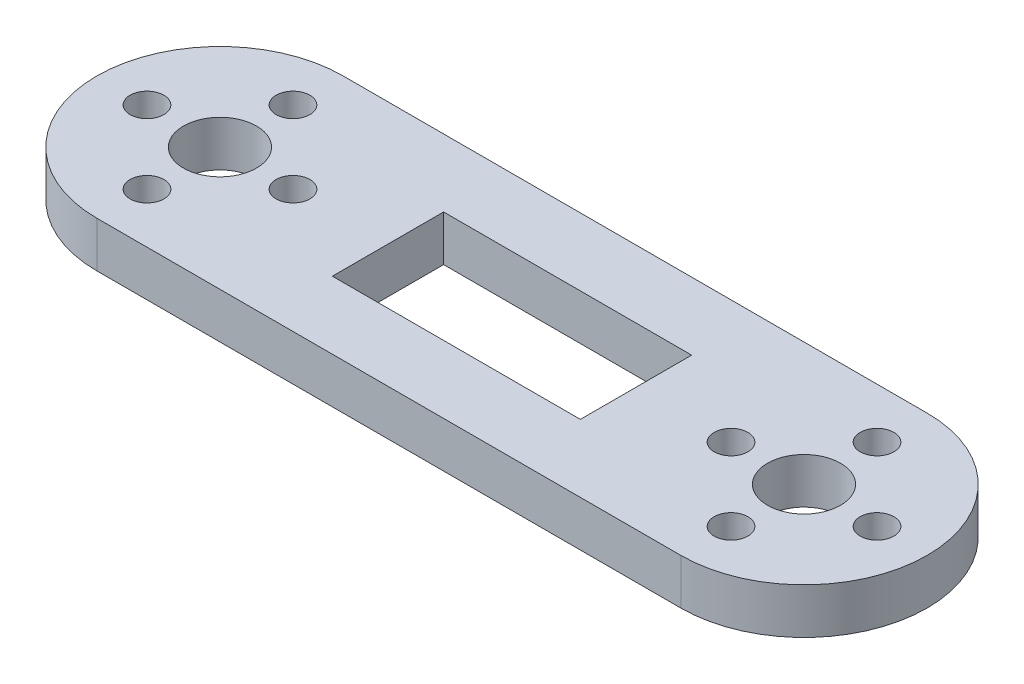
ISO-10303-21;
HEADER;
FILE_DESCRIPTION(('STEP AP214'),'2;1');
FILE_NAME('part.step','',(''),(''),'','','');
FILE_SCHEMA(('AUTOMOTIVE_DESIGN { 1 0 10303 214 1 1 1 1 }'));
ENDSEC;
DATA;
#1=APPLICATION_CONTEXT('core data for automotive mechanical design processes');
#2=APPLICATION_PROTOCOL_DEFINITION('international standard','automotive_design',2000,#1);
#3=PRODUCT_CONTEXT('',#1,'mechanical');
#4=PRODUCT('Part','Part','',(#3));
#5=PRODUCT_RELATED_PRODUCT_CATEGORY('part','',(#4));
#6=PRODUCT_DEFINITION_FORMATION('','',#4);
#7=PRODUCT_DEFINITION_CONTEXT('part definition',#1,'design');
#8=PRODUCT_DEFINITION('design','',#6,#7);
#9=PRODUCT_DEFINITION_SHAPE('','',#8);
#10=(LENGTH_UNIT() NAMED_UNIT(*) SI_UNIT(.MILLI.,.METRE.));
#11=(NAMED_UNIT(*) PLANE_ANGLE_UNIT() SI_UNIT($,.RADIAN.));
#12=(NAMED_UNIT(*) SI_UNIT($,.STERADIAN.) SOLID_ANGLE_UNIT());
#13=UNCERTAINTY_MEASURE_WITH_UNIT(LENGTH_MEASURE(1.E-05),#10,'distance_accuracy_value','');
#14=(GEOMETRIC_REPRESENTATION_CONTEXT(3) GLOBAL_UNCERTAINTY_ASSIGNED_CONTEXT((#13)) GLOBAL_UNIT_ASSIGNED_CONTEXT((#10,
#11,#12)) REPRESENTATION_CONTEXT('',''));
#15=CARTESIAN_POINT('',(0.,0.,0.));
#16=DIRECTION('',(0.,0.,1.));
#17=DIRECTION('',(1.,0.,0.));
#18=AXIS2_PLACEMENT_3D('',#15,#16,#17);
#19=CARTESIAN_POINT('',(64.,0.,0.));
#20=DIRECTION('',(0.,1.,0.));
#21=DIRECTION('',(0.,0.,1.));
#22=AXIS2_PLACEMENT_3D('',#19,#20,#21);
#23=CYLINDRICAL_SURFACE('',#22,13.5);
#24=CARTESIAN_POINT('',(64.,5.,0.));
#25=DIRECTION('',(0.,1.,0.));
#26=DIRECTION('',(0.,0.,1.));
#27=AXIS2_PLACEMENT_3D('',#24,#25,#26);
#28=CIRCLE('',#27,13.5);
#29=CARTESIAN_POINT('',(64.,5.,13.5));
#30=VERTEX_POINT('',#29);
#31=CARTESIAN_POINT('',(64.,5.,-13.5));
#32=VERTEX_POINT('',#31);
#33=EDGE_CURVE('E139',#30,#32,#28,.T.);
#34=ORIENTED_EDGE('',*,*,#33,.F.);
#35=DIRECTION('',(0.,1.,0.));
#36=VECTOR('',#35,1.);
#37=CARTESIAN_POINT('',(64.,0.,13.5));
#38=LINE('',#37,#36);
#39=CARTESIAN_POINT('',(64.,0.,13.5));
#40=VERTEX_POINT('',#39);
#41=EDGE_CURVE('E11',#40,#30,#38,.T.);
#42=ORIENTED_EDGE('',*,*,#41,.F.);
#43=CARTESIAN_POINT('',(64.,0.,0.));
#44=DIRECTION('',(0.,1.,0.));
#45=DIRECTION('',(0.,0.,1.));
#46=AXIS2_PLACEMENT_3D('',#43,#44,#45);
#47=CIRCLE('',#46,13.5);
#48=CARTESIAN_POINT('',(64.,0.,-13.5));
#49=VERTEX_POINT('',#48);
#50=EDGE_CURVE('E143',#40,#49,#47,.T.);
#51=ORIENTED_EDGE('',*,*,#50,.T.);
#52=DIRECTION('',(0.,1.,0.));
#53=VECTOR('',#52,1.);
#54=CARTESIAN_POINT('',(64.,0.,-13.5));
#55=LINE('',#54,#53);
#56=EDGE_CURVE('E40',#49,#32,#55,.T.);
#57=ORIENTED_EDGE('',*,*,#56,.T.);
#58=EDGE_LOOP('',(#34,#42,#51,#57));
#59=FACE_BOUND('',#58,.T.);
#60=ADVANCED_FACE('F37',(#59),#23,.T.);
#61=CARTESIAN_POINT('',(0.,0.,13.5));
#62=DIRECTION('',(0.,0.,1.));
#63=DIRECTION('',(1.,0.,0.));
#64=AXIS2_PLACEMENT_3D('',#61,#62,#63);
#65=PLANE('',#64);
#66=DIRECTION('',(1.,0.,0.));
#67=VECTOR('',#66,1.);
#68=CARTESIAN_POINT('',(0.,5.,13.5));
#69=LINE('',#68,#67);
#70=CARTESIAN_POINT('',(0.,5.,13.5));
#71=VERTEX_POINT('',#70);
#72=EDGE_CURVE('E147',#71,#30,#69,.T.);
#73=ORIENTED_EDGE('',*,*,#72,.F.);
#74=DIRECTION('',(0.,1.,0.));
#75=VECTOR('',#74,1.);
#76=CARTESIAN_POINT('',(0.,0.,13.5));
#77=LINE('',#76,#75);
#78=CARTESIAN_POINT('',(0.,0.,13.5));
#79=VERTEX_POINT('',#78);
#80=EDGE_CURVE('E45',#79,#71,#77,.T.);
#81=ORIENTED_EDGE('',*,*,#80,.F.);
#82=DIRECTION('',(1.,0.,0.));
#83=VECTOR('',#82,1.);
#84=CARTESIAN_POINT('',(0.,0.,13.5));
#85=LINE('',#84,#83);
#86=EDGE_CURVE('E153',#79,#40,#85,.T.);
#87=ORIENTED_EDGE('',*,*,#86,.T.);
#88=ORIENTED_EDGE('',*,*,#41,.T.);
#89=EDGE_LOOP('',(#73,#81,#87,#88));
#90=FACE_BOUND('',#89,.T.);
#91=ADVANCED_FACE('F179',(#90),#65,.T.);
#92=CARTESIAN_POINT('',(0.,0.,0.));
#93=DIRECTION('',(0.,1.,0.));
#94=DIRECTION('',(0.,0.,1.));
#95=AXIS2_PLACEMENT_3D('',#92,#93,#94);
#96=CYLINDRICAL_SURFACE('',#95,13.5);
#97=CARTESIAN_POINT('',(0.,5.,0.));
#98=DIRECTION('',(0.,1.,0.));
#99=DIRECTION('',(0.,0.,1.));
#100=AXIS2_PLACEMENT_3D('',#97,#98,#99);
#101=CIRCLE('',#100,13.5);
#102=CARTESIAN_POINT('',(0.,5.,-13.5));
#103=VERTEX_POINT('',#102);
#104=EDGE_CURVE('E161',#103,#71,#101,.T.);
#105=ORIENTED_EDGE('',*,*,#104,.F.);
#106=DIRECTION('',(0.,1.,0.));
#107=VECTOR('',#106,1.);
#108=CARTESIAN_POINT('',(0.,0.,-13.5));
#109=LINE('',#108,#107);
#110=CARTESIAN_POINT('',(0.,0.,-13.5));
#111=VERTEX_POINT('',#110);
#112=EDGE_CURVE('E166',#111,#103,#109,.T.);
#113=ORIENTED_EDGE('',*,*,#112,.F.);
#114=CARTESIAN_POINT('',(0.,0.,0.));
#115=DIRECTION('',(0.,1.,0.));
#116=DIRECTION('',(0.,0.,1.));
#117=AXIS2_PLACEMENT_3D('',#114,#115,#116);
#118=CIRCLE('',#117,13.5);
#119=EDGE_CURVE('E150',#111,#79,#118,.T.);
#120=ORIENTED_EDGE('',*,*,#119,.T.);
#121=ORIENTED_EDGE('',*,*,#80,.T.);
#122=EDGE_LOOP('',(#105,#113,#120,#121));
#123=FACE_BOUND('',#122,.T.);
#124=ADVANCED_FACE('F183',(#123),#96,.T.);
#125=CARTESIAN_POINT('',(64.,0.,-13.5));
#126=DIRECTION('',(0.,0.,-1.));
#127=DIRECTION('',(-1.,0.,0.));
#128=AXIS2_PLACEMENT_3D('',#125,#126,#127);
#129=PLANE('',#128);
#130=DIRECTION('',(-1.,0.,0.));
#131=VECTOR('',#130,1.);
#132=CARTESIAN_POINT('',(64.,5.,-13.5));
#133=LINE('',#132,#131);
#134=EDGE_CURVE('E158',#32,#103,#133,.T.);
#135=ORIENTED_EDGE('',*,*,#134,.F.);
#136=ORIENTED_EDGE('',*,*,#56,.F.);
#137=DIRECTION('',(-1.,0.,0.));
#138=VECTOR('',#137,1.);
#139=CARTESIAN_POINT('',(64.,0.,-13.5));
#140=LINE('',#139,#138);
#141=EDGE_CURVE('E146',#49,#111,#140,.T.);
#142=ORIENTED_EDGE('',*,*,#141,.T.);
#143=ORIENTED_EDGE('',*,*,#112,.T.);
#144=EDGE_LOOP('',(#135,#136,#142,#143));
#145=FACE_BOUND('',#144,.T.);
#146=ADVANCED_FACE('F174',(#145),#129,.T.);
#147=CARTESIAN_POINT('',(64.,0.,0.));
#148=DIRECTION('',(0.,1.,0.));
#149=DIRECTION('',(0.,0.,1.));
#150=AXIS2_PLACEMENT_3D('',#147,#148,#149);
#151=PLANE('',#150);
#152=CARTESIAN_POINT('',(0.,0.,0.));
#153=DIRECTION('',(0.,1.,0.));
#154=DIRECTION('',(0.,0.,-1.));
#155=AXIS2_PLACEMENT_3D('',#152,#153,#154);
#156=CIRCLE('',#155,4.);
#157=CARTESIAN_POINT('',(0.,0.,-4.));
#158=VERTEX_POINT('',#157);
#159=EDGE_CURVE('E368',#158,#158,#156,.T.);
#160=ORIENTED_EDGE('',*,*,#159,.T.);
#161=EDGE_LOOP('',(#160));
#162=FACE_BOUND('',#161,.T.);
#163=CARTESIAN_POINT('',(0.,0.,-8.));
#164=DIRECTION('',(0.,1.,0.));
#165=DIRECTION('',(0.,0.,-1.));
#166=AXIS2_PLACEMENT_3D('',#163,#164,#165);
#167=CIRCLE('',#166,1.85);
#168=CARTESIAN_POINT('',(0.,0.,-9.85));
#169=VERTEX_POINT('',#168);
#170=EDGE_CURVE('E376',#169,#169,#167,.T.);
#171=ORIENTED_EDGE('',*,*,#170,.T.);
#172=EDGE_LOOP('',(#171));
#173=FACE_BOUND('',#172,.T.);
#174=CARTESIAN_POINT('',(8.,0.,0.));
#175=DIRECTION('',(0.,1.,0.));
#176=DIRECTION('',(0.,0.,-1.));
#177=AXIS2_PLACEMENT_3D('',#174,#175,#176);
#178=CIRCLE('',#177,1.85);
#179=CARTESIAN_POINT('',(8.,0.,-1.85));
#180=VERTEX_POINT('',#179);
#181=EDGE_CURVE('E382',#180,#180,#178,.T.);
#182=ORIENTED_EDGE('',*,*,#181,.T.);
#183=EDGE_LOOP('',(#182));
#184=FACE_BOUND('',#183,.T.);
#185=CARTESIAN_POINT('',(0.,0.,8.));
#186=DIRECTION('',(0.,1.,0.));
#187=DIRECTION('',(0.,0.,-1.));
#188=AXIS2_PLACEMENT_3D('',#185,#186,#187);
#189=CIRCLE('',#188,1.85);
#190=CARTESIAN_POINT('',(0.,0.,6.15));
#191=VERTEX_POINT('',#190);
#192=EDGE_CURVE('E388',#191,#191,#189,.T.);
#193=ORIENTED_EDGE('',*,*,#192,.T.);
#194=EDGE_LOOP('',(#193));
#195=FACE_BOUND('',#194,.T.);
#196=CARTESIAN_POINT('',(-8.,0.,0.));
#197=DIRECTION('',(0.,1.,0.));
#198=DIRECTION('',(0.,0.,-1.));
#199=AXIS2_PLACEMENT_3D('',#196,#197,#198);
#200=CIRCLE('',#199,1.85);
#201=CARTESIAN_POINT('',(-8.,0.,-1.85));
#202=VERTEX_POINT('',#201);
#203=EDGE_CURVE('E394',#202,#202,#200,.T.);
#204=ORIENTED_EDGE('',*,*,#203,.T.);
#205=EDGE_LOOP('',(#204));
#206=FACE_BOUND('',#205,.T.);
#207=CARTESIAN_POINT('',(64.,0.,0.));
#208=DIRECTION('',(0.,1.,0.));
#209=DIRECTION('',(0.,0.,-1.));
#210=AXIS2_PLACEMENT_3D('',#207,#208,#209);
#211=CIRCLE('',#210,4.);
#212=CARTESIAN_POINT('',(64.,0.,-4.));
#213=VERTEX_POINT('',#212);
#214=EDGE_CURVE('E400',#213,#213,#211,.T.);
#215=ORIENTED_EDGE('',*,*,#214,.T.);
#216=EDGE_LOOP('',(#215));
#217=FACE_BOUND('',#216,.T.);
#218=CARTESIAN_POINT('',(64.,0.,-8.));
#219=DIRECTION('',(0.,1.,0.));
#220=DIRECTION('',(0.,0.,-1.));
#221=AXIS2_PLACEMENT_3D('',#218,#219,#220);
#222=CIRCLE('',#221,1.85);
#223=CARTESIAN_POINT('',(64.,0.,-9.85));
#224=VERTEX_POINT('',#223);
#225=EDGE_CURVE('E406',#224,#224,#222,.T.);
#226=ORIENTED_EDGE('',*,*,#225,.T.);
#227=EDGE_LOOP('',(#226));
#228=FACE_BOUND('',#227,.T.);
#229=CARTESIAN_POINT('',(72.,0.,0.));
#230=DIRECTION('',(0.,1.,0.));
#231=DIRECTION('',(0.,0.,-1.));
#232=AXIS2_PLACEMENT_3D('',#229,#230,#231);
#233=CIRCLE('',#232,1.85);
#234=CARTESIAN_POINT('',(72.,0.,-1.85));
#235=VERTEX_POINT('',#234);
#236=EDGE_CURVE('E412',#235,#235,#233,.T.);
#237=ORIENTED_EDGE('',*,*,#236,.T.);
#238=EDGE_LOOP('',(#237));
#239=FACE_BOUND('',#238,.T.);
#240=CARTESIAN_POINT('',(64.,0.,8.));
#241=DIRECTION('',(0.,1.,0.));
#242=DIRECTION('',(0.,0.,-1.));
#243=AXIS2_PLACEMENT_3D('',#240,#241,#242);
#244=CIRCLE('',#243,1.85);
#245=CARTESIAN_POINT('',(64.,0.,6.15));
#246=VERTEX_POINT('',#245);
#247=EDGE_CURVE('E418',#246,#246,#244,.T.);
#248=ORIENTED_EDGE('',*,*,#247,.T.);
#249=EDGE_LOOP('',(#248));
#250=FACE_BOUND('',#249,.T.);
#251=CARTESIAN_POINT('',(56.,0.,0.));
#252=DIRECTION('',(0.,1.,0.));
#253=DIRECTION('',(0.,0.,-1.));
#254=AXIS2_PLACEMENT_3D('',#251,#252,#253);
#255=CIRCLE('',#254,1.85);
#256=CARTESIAN_POINT('',(56.,0.,-1.85));
#257=VERTEX_POINT('',#256);
#258=EDGE_CURVE('E133',#257,#257,#255,.T.);
#259=ORIENTED_EDGE('',*,*,#258,.T.);
#260=EDGE_LOOP('',(#259));
#261=FACE_BOUND('',#260,.T.);
#262=DIRECTION('',(1.,0.,0.));
#263=VECTOR('',#262,1.);
#264=CARTESIAN_POINT('',(45.589,0.,6.096));
#265=LINE('',#264,#263);
#266=CARTESIAN_POINT('',(18.411,0.,6.096));
#267=VERTEX_POINT('',#266);
#268=CARTESIAN_POINT('',(45.589,0.,6.096));
#269=VERTEX_POINT('',#268);
#270=EDGE_CURVE('E110',#267,#269,#265,.T.);
#271=ORIENTED_EDGE('',*,*,#270,.T.);
#272=DIRECTION('',(0.,0.,-1.));
#273=VECTOR('',#272,1.);
#274=CARTESIAN_POINT('',(45.589,0.,-6.096));
#275=LINE('',#274,#273);
#276=CARTESIAN_POINT('',(45.589,0.,-6.096));
#277=VERTEX_POINT('',#276);
#278=EDGE_CURVE('E104',#269,#277,#275,.T.);
#279=ORIENTED_EDGE('',*,*,#278,.T.);
#280=DIRECTION('',(-1.,0.,0.));
#281=VECTOR('',#280,1.);
#282=CARTESIAN_POINT('',(18.411,0.,-6.096));
#283=LINE('',#282,#281);
#284=CARTESIAN_POINT('',(18.411,0.,-6.096));
#285=VERTEX_POINT('',#284);
#286=EDGE_CURVE('E113',#277,#285,#283,.T.);
#287=ORIENTED_EDGE('',*,*,#286,.T.);
#288=DIRECTION('',(0.,0.,1.));
#289=VECTOR('',#288,1.);
#290=CARTESIAN_POINT('',(18.411,0.,6.096));
#291=LINE('',#290,#289);
#292=EDGE_CURVE('E53',#285,#267,#291,.T.);
#293=ORIENTED_EDGE('',*,*,#292,.T.);
#294=EDGE_LOOP('',(#271,#279,#287,#293));
#295=FACE_BOUND('',#294,.T.);
#296=ORIENTED_EDGE('',*,*,#50,.F.);
#297=ORIENTED_EDGE('',*,*,#86,.F.);
#298=ORIENTED_EDGE('',*,*,#119,.F.);
#299=ORIENTED_EDGE('',*,*,#141,.F.);
#300=EDGE_LOOP('',(#296,#297,#298,#299));
#301=FACE_BOUND('',#300,.T.);
#302=ADVANCED_FACE('F117',(#162,#173,#184,#195,#206,#217,#228,#239,#250,#261,#295,#301),#151,.F.);
#303=CARTESIAN_POINT('',(64.,5.,0.));
#304=DIRECTION('',(0.,1.,0.));
#305=DIRECTION('',(0.,0.,1.));
#306=AXIS2_PLACEMENT_3D('',#303,#304,#305);
#307=PLANE('',#306);
#308=CARTESIAN_POINT('',(0.,5.,0.));
#309=DIRECTION('',(0.,1.,0.));
#310=DIRECTION('',(0.,0.,-1.));
#311=AXIS2_PLACEMENT_3D('',#308,#309,#310);
#312=CIRCLE('',#311,4.);
#313=CARTESIAN_POINT('',(0.,5.,-4.));
#314=VERTEX_POINT('',#313);
#315=EDGE_CURVE('E371',#314,#314,#312,.T.);
#316=ORIENTED_EDGE('',*,*,#315,.F.);
#317=EDGE_LOOP('',(#316));
#318=FACE_BOUND('',#317,.T.);
#319=CARTESIAN_POINT('',(0.,5.,-8.));
#320=DIRECTION('',(0.,1.,0.));
#321=DIRECTION('',(0.,0.,-1.));
#322=AXIS2_PLACEMENT_3D('',#319,#320,#321);
#323=CIRCLE('',#322,1.85);
#324=CARTESIAN_POINT('',(0.,5.,-9.85));
#325=VERTEX_POINT('',#324);
#326=EDGE_CURVE('E373',#325,#325,#323,.T.);
#327=ORIENTED_EDGE('',*,*,#326,.F.);
#328=EDGE_LOOP('',(#327));
#329=FACE_BOUND('',#328,.T.);
#330=CARTESIAN_POINT('',(8.,5.,0.));
#331=DIRECTION('',(0.,1.,0.));
#332=DIRECTION('',(0.,0.,-1.));
#333=AXIS2_PLACEMENT_3D('',#330,#331,#332);
#334=CIRCLE('',#333,1.85);
#335=CARTESIAN_POINT('',(8.,5.,-1.85));
#336=VERTEX_POINT('',#335);
#337=EDGE_CURVE('E379',#336,#336,#334,.T.);
#338=ORIENTED_EDGE('',*,*,#337,.F.);
#339=EDGE_LOOP('',(#338));
#340=FACE_BOUND('',#339,.T.);
#341=CARTESIAN_POINT('',(0.,5.,8.));
#342=DIRECTION('',(0.,1.,0.));
#343=DIRECTION('',(0.,0.,-1.));
#344=AXIS2_PLACEMENT_3D('',#341,#342,#343);
#345=CIRCLE('',#344,1.85);
#346=CARTESIAN_POINT('',(0.,5.,6.15));
#347=VERTEX_POINT('',#346);
#348=EDGE_CURVE('E385',#347,#347,#345,.T.);
#349=ORIENTED_EDGE('',*,*,#348,.F.);
#350=EDGE_LOOP('',(#349));
#351=FACE_BOUND('',#350,.T.);
#352=CARTESIAN_POINT('',(-8.,5.,0.));
#353=DIRECTION('',(0.,1.,0.));
#354=DIRECTION('',(0.,0.,-1.));
#355=AXIS2_PLACEMENT_3D('',#352,#353,#354);
#356=CIRCLE('',#355,1.85);
#357=CARTESIAN_POINT('',(-8.,5.,-1.85));
#358=VERTEX_POINT('',#357);
#359=EDGE_CURVE('E391',#358,#358,#356,.T.);
#360=ORIENTED_EDGE('',*,*,#359,.F.);
#361=EDGE_LOOP('',(#360));
#362=FACE_BOUND('',#361,.T.);
#363=CARTESIAN_POINT('',(64.,5.,0.));
#364=DIRECTION('',(0.,1.,0.));
#365=DIRECTION('',(0.,0.,-1.));
#366=AXIS2_PLACEMENT_3D('',#363,#364,#365);
#367=CIRCLE('',#366,4.);
#368=CARTESIAN_POINT('',(64.,5.,-4.));
#369=VERTEX_POINT('',#368);
#370=EDGE_CURVE('E397',#369,#369,#367,.T.);
#371=ORIENTED_EDGE('',*,*,#370,.F.);
#372=EDGE_LOOP('',(#371));
#373=FACE_BOUND('',#372,.T.);
#374=CARTESIAN_POINT('',(64.,5.,-8.));
#375=DIRECTION('',(0.,1.,0.));
#376=DIRECTION('',(0.,0.,-1.));
#377=AXIS2_PLACEMENT_3D('',#374,#375,#376);
#378=CIRCLE('',#377,1.85);
#379=CARTESIAN_POINT('',(64.,5.,-9.85));
#380=VERTEX_POINT('',#379);
#381=EDGE_CURVE('E403',#380,#380,#378,.T.);
#382=ORIENTED_EDGE('',*,*,#381,.F.);
#383=EDGE_LOOP('',(#382));
#384=FACE_BOUND('',#383,.T.);
#385=CARTESIAN_POINT('',(72.,5.,0.));
#386=DIRECTION('',(0.,1.,0.));
#387=DIRECTION('',(0.,0.,-1.));
#388=AXIS2_PLACEMENT_3D('',#385,#386,#387);
#389=CIRCLE('',#388,1.85);
#390=CARTESIAN_POINT('',(72.,5.,-1.85));
#391=VERTEX_POINT('',#390);
#392=EDGE_CURVE('E409',#391,#391,#389,.T.);
#393=ORIENTED_EDGE('',*,*,#392,.F.);
#394=EDGE_LOOP('',(#393));
#395=FACE_BOUND('',#394,.T.);
#396=CARTESIAN_POINT('',(64.,5.,8.));
#397=DIRECTION('',(0.,1.,0.));
#398=DIRECTION('',(0.,0.,-1.));
#399=AXIS2_PLACEMENT_3D('',#396,#397,#398);
#400=CIRCLE('',#399,1.85);
#401=CARTESIAN_POINT('',(64.,5.,6.15));
#402=VERTEX_POINT('',#401);
#403=EDGE_CURVE('E415',#402,#402,#400,.T.);
#404=ORIENTED_EDGE('',*,*,#403,.F.);
#405=EDGE_LOOP('',(#404));
#406=FACE_BOUND('',#405,.T.);
#407=CARTESIAN_POINT('',(56.,5.,0.));
#408=DIRECTION('',(0.,1.,0.));
#409=DIRECTION('',(0.,0.,-1.));
#410=AXIS2_PLACEMENT_3D('',#407,#408,#409);
#411=CIRCLE('',#410,1.85);
#412=CARTESIAN_POINT('',(56.,5.,-1.85));
#413=VERTEX_POINT('',#412);
#414=EDGE_CURVE('E126',#413,#413,#411,.T.);
#415=ORIENTED_EDGE('',*,*,#414,.F.);
#416=EDGE_LOOP('',(#415));
#417=FACE_BOUND('',#416,.T.);
#418=DIRECTION('',(0.,0.,-1.));
#419=VECTOR('',#418,1.);
#420=CARTESIAN_POINT('',(45.589,5.,-6.096));
#421=LINE('',#420,#419);
#422=CARTESIAN_POINT('',(45.589,5.,6.096));
#423=VERTEX_POINT('',#422);
#424=CARTESIAN_POINT('',(45.589,5.,-6.096));
#425=VERTEX_POINT('',#424);
#426=EDGE_CURVE('E61',#423,#425,#421,.T.);
#427=ORIENTED_EDGE('',*,*,#426,.F.);
#428=DIRECTION('',(1.,0.,0.));
#429=VECTOR('',#428,1.);
#430=CARTESIAN_POINT('',(45.589,5.,6.096));
#431=LINE('',#430,#429);
#432=CARTESIAN_POINT('',(18.411,5.,6.096));
#433=VERTEX_POINT('',#432);
#434=EDGE_CURVE('E120',#433,#423,#431,.T.);
#435=ORIENTED_EDGE('',*,*,#434,.F.);
#436=DIRECTION('',(0.,0.,1.));
#437=VECTOR('',#436,1.);
#438=CARTESIAN_POINT('',(18.411,5.,6.096));
#439=LINE('',#438,#437);
#440=CARTESIAN_POINT('',(18.411,5.,-6.096));
#441=VERTEX_POINT('',#440);
#442=EDGE_CURVE('E123',#441,#433,#439,.T.);
#443=ORIENTED_EDGE('',*,*,#442,.F.);
#444=DIRECTION('',(-1.,0.,0.));
#445=VECTOR('',#444,1.);
#446=CARTESIAN_POINT('',(18.411,5.,-6.096));
#447=LINE('',#446,#445);
#448=EDGE_CURVE('E132',#425,#441,#447,.T.);
#449=ORIENTED_EDGE('',*,*,#448,.F.);
#450=EDGE_LOOP('',(#427,#435,#443,#449));
#451=FACE_BOUND('',#450,.T.);
#452=ORIENTED_EDGE('',*,*,#33,.T.);
#453=ORIENTED_EDGE('',*,*,#134,.T.);
#454=ORIENTED_EDGE('',*,*,#104,.T.);
#455=ORIENTED_EDGE('',*,*,#72,.T.);
#456=EDGE_LOOP('',(#452,#453,#454,#455));
#457=FACE_BOUND('',#456,.T.);
#458=ADVANCED_FACE('F176',(#318,#329,#340,#351,#362,#373,#384,#395,#406,#417,#451,#457),#307,.T.);
#459=CARTESIAN_POINT('',(45.589,0.,-6.096));
#460=DIRECTION('',(1.,0.,0.));
#461=DIRECTION('',(0.,0.,-1.));
#462=AXIS2_PLACEMENT_3D('',#459,#460,#461);
#463=PLANE('',#462);
#464=ORIENTED_EDGE('',*,*,#426,.T.);
#465=DIRECTION('',(0.,1.,0.));
#466=VECTOR('',#465,1.);
#467=CARTESIAN_POINT('',(45.589,0.,-6.096));
#468=LINE('',#467,#466);
#469=EDGE_CURVE('E100',#277,#425,#468,.T.);
#470=ORIENTED_EDGE('',*,*,#469,.F.);
#471=ORIENTED_EDGE('',*,*,#278,.F.);
#472=DIRECTION('',(0.,1.,0.));
#473=VECTOR('',#472,1.);
#474=CARTESIAN_POINT('',(45.589,0.,6.096));
#475=LINE('',#474,#473);
#476=EDGE_CURVE('E137',#269,#423,#475,.T.);
#477=ORIENTED_EDGE('',*,*,#476,.T.);
#478=EDGE_LOOP('',(#464,#470,#471,#477));
#479=FACE_BOUND('',#478,.T.);
#480=ADVANCED_FACE('F102',(#479),#463,.F.);
#481=CARTESIAN_POINT('',(45.589,0.,6.096));
#482=DIRECTION('',(0.,0.,1.));
#483=DIRECTION('',(1.,0.,0.));
#484=AXIS2_PLACEMENT_3D('',#481,#482,#483);
#485=PLANE('',#484);
#486=ORIENTED_EDGE('',*,*,#434,.T.);
#487=ORIENTED_EDGE('',*,*,#476,.F.);
#488=ORIENTED_EDGE('',*,*,#270,.F.);
#489=DIRECTION('',(0.,1.,0.));
#490=VECTOR('',#489,1.);
#491=CARTESIAN_POINT('',(18.411,0.,6.096));
#492=LINE('',#491,#490);
#493=EDGE_CURVE('E140',#267,#433,#492,.T.);
#494=ORIENTED_EDGE('',*,*,#493,.T.);
#495=EDGE_LOOP('',(#486,#487,#488,#494));
#496=FACE_BOUND('',#495,.T.);
#497=ADVANCED_FACE('F235',(#496),#485,.F.);
#498=CARTESIAN_POINT('',(18.411,0.,6.096));
#499=DIRECTION('',(-1.,0.,0.));
#500=DIRECTION('',(0.,0.,1.));
#501=AXIS2_PLACEMENT_3D('',#498,#499,#500);
#502=PLANE('',#501);
#503=ORIENTED_EDGE('',*,*,#442,.T.);
#504=ORIENTED_EDGE('',*,*,#493,.F.);
#505=ORIENTED_EDGE('',*,*,#292,.F.);
#506=DIRECTION('',(0.,1.,0.));
#507=VECTOR('',#506,1.);
#508=CARTESIAN_POINT('',(18.411,0.,-6.096));
#509=LINE('',#508,#507);
#510=EDGE_CURVE('E109',#285,#441,#509,.T.);
#511=ORIENTED_EDGE('',*,*,#510,.T.);
#512=EDGE_LOOP('',(#503,#504,#505,#511));
#513=FACE_BOUND('',#512,.T.);
#514=ADVANCED_FACE('F244',(#513),#502,.F.);
#515=CARTESIAN_POINT('',(18.411,0.,-6.096));
#516=DIRECTION('',(0.,0.,-1.));
#517=DIRECTION('',(-1.,0.,0.));
#518=AXIS2_PLACEMENT_3D('',#515,#516,#517);
#519=PLANE('',#518);
#520=ORIENTED_EDGE('',*,*,#448,.T.);
#521=ORIENTED_EDGE('',*,*,#510,.F.);
#522=ORIENTED_EDGE('',*,*,#286,.F.);
#523=ORIENTED_EDGE('',*,*,#469,.T.);
#524=EDGE_LOOP('',(#520,#521,#522,#523));
#525=FACE_BOUND('',#524,.T.);
#526=ADVANCED_FACE('F114',(#525),#519,.F.);
#527=CARTESIAN_POINT('',(56.,0.,0.));
#528=DIRECTION('',(0.,1.,0.));
#529=DIRECTION('',(0.,0.,1.));
#530=AXIS2_PLACEMENT_3D('',#527,#528,#529);
#531=CYLINDRICAL_SURFACE('',#530,1.85);
#532=ORIENTED_EDGE('',*,*,#258,.F.);
#533=EDGE_LOOP('',(#532));
#534=FACE_BOUND('',#533,.T.);
#535=ORIENTED_EDGE('',*,*,#414,.T.);
#536=EDGE_LOOP('',(#535));
#537=FACE_BOUND('',#536,.T.);
#538=ADVANCED_FACE('F262',(#534,#537),#531,.F.);
#539=CARTESIAN_POINT('',(64.,0.,8.));
#540=DIRECTION('',(0.,1.,0.));
#541=DIRECTION('',(0.,0.,1.));
#542=AXIS2_PLACEMENT_3D('',#539,#540,#541);
#543=CYLINDRICAL_SURFACE('',#542,1.85);
#544=ORIENTED_EDGE('',*,*,#247,.F.);
#545=EDGE_LOOP('',(#544));
#546=FACE_BOUND('',#545,.T.);
#547=ORIENTED_EDGE('',*,*,#403,.T.);
#548=EDGE_LOOP('',(#547));
#549=FACE_BOUND('',#548,.T.);
#550=ADVANCED_FACE('F271',(#546,#549),#543,.F.);
#551=CARTESIAN_POINT('',(72.,0.,0.));
#552=DIRECTION('',(0.,1.,0.));
#553=DIRECTION('',(0.,0.,1.));
#554=AXIS2_PLACEMENT_3D('',#551,#552,#553);
#555=CYLINDRICAL_SURFACE('',#554,1.85);
#556=ORIENTED_EDGE('',*,*,#236,.F.);
#557=EDGE_LOOP('',(#556));
#558=FACE_BOUND('',#557,.T.);
#559=ORIENTED_EDGE('',*,*,#392,.T.);
#560=EDGE_LOOP('',(#559));
#561=FACE_BOUND('',#560,.T.);
#562=ADVANCED_FACE('F281',(#558,#561),#555,.F.);
#563=CARTESIAN_POINT('',(64.,0.,-8.));
#564=DIRECTION('',(0.,1.,0.));
#565=DIRECTION('',(0.,0.,1.));
#566=AXIS2_PLACEMENT_3D('',#563,#564,#565);
#567=CYLINDRICAL_SURFACE('',#566,1.85);
#568=ORIENTED_EDGE('',*,*,#225,.F.);
#569=EDGE_LOOP('',(#568));
#570=FACE_BOUND('',#569,.T.);
#571=ORIENTED_EDGE('',*,*,#381,.T.);
#572=EDGE_LOOP('',(#571));
#573=FACE_BOUND('',#572,.T.);
#574=ADVANCED_FACE('F291',(#570,#573),#567,.F.);
#575=CARTESIAN_POINT('',(64.,0.,0.));
#576=DIRECTION('',(0.,1.,0.));
#577=DIRECTION('',(0.,0.,1.));
#578=AXIS2_PLACEMENT_3D('',#575,#576,#577);
#579=CYLINDRICAL_SURFACE('',#578,4.);
#580=ORIENTED_EDGE('',*,*,#214,.F.);
#581=EDGE_LOOP('',(#580));
#582=FACE_BOUND('',#581,.T.);
#583=ORIENTED_EDGE('',*,*,#370,.T.);
#584=EDGE_LOOP('',(#583));
#585=FACE_BOUND('',#584,.T.);
#586=ADVANCED_FACE('F301',(#582,#585),#579,.F.);
#587=CARTESIAN_POINT('',(-8.,0.,0.));
#588=DIRECTION('',(0.,1.,0.));
#589=DIRECTION('',(0.,0.,1.));
#590=AXIS2_PLACEMENT_3D('',#587,#588,#589);
#591=CYLINDRICAL_SURFACE('',#590,1.85);
#592=ORIENTED_EDGE('',*,*,#203,.F.);
#593=EDGE_LOOP('',(#592));
#594=FACE_BOUND('',#593,.T.);
#595=ORIENTED_EDGE('',*,*,#359,.T.);
#596=EDGE_LOOP('',(#595));
#597=FACE_BOUND('',#596,.T.);
#598=ADVANCED_FACE('F311',(#594,#597),#591,.F.);
#599=CARTESIAN_POINT('',(0.,0.,8.));
#600=DIRECTION('',(0.,1.,0.));
#601=DIRECTION('',(0.,0.,1.));
#602=AXIS2_PLACEMENT_3D('',#599,#600,#601);
#603=CYLINDRICAL_SURFACE('',#602,1.85);
#604=ORIENTED_EDGE('',*,*,#192,.F.);
#605=EDGE_LOOP('',(#604));
#606=FACE_BOUND('',#605,.T.);
#607=ORIENTED_EDGE('',*,*,#348,.T.);
#608=EDGE_LOOP('',(#607));
#609=FACE_BOUND('',#608,.T.);
#610=ADVANCED_FACE('F321',(#606,#609),#603,.F.);
#611=CARTESIAN_POINT('',(8.,0.,0.));
#612=DIRECTION('',(0.,1.,0.));
#613=DIRECTION('',(0.,0.,1.));
#614=AXIS2_PLACEMENT_3D('',#611,#612,#613);
#615=CYLINDRICAL_SURFACE('',#614,1.85);
#616=ORIENTED_EDGE('',*,*,#181,.F.);
#617=EDGE_LOOP('',(#616));
#618=FACE_BOUND('',#617,.T.);
#619=ORIENTED_EDGE('',*,*,#337,.T.);
#620=EDGE_LOOP('',(#619));
#621=FACE_BOUND('',#620,.T.);
#622=ADVANCED_FACE('F331',(#618,#621),#615,.F.);
#623=CARTESIAN_POINT('',(0.,0.,-8.));
#624=DIRECTION('',(0.,1.,0.));
#625=DIRECTION('',(0.,0.,1.));
#626=AXIS2_PLACEMENT_3D('',#623,#624,#625);
#627=CYLINDRICAL_SURFACE('',#626,1.85);
#628=ORIENTED_EDGE('',*,*,#170,.F.);
#629=EDGE_LOOP('',(#628));
#630=FACE_BOUND('',#629,.T.);
#631=ORIENTED_EDGE('',*,*,#326,.T.);
#632=EDGE_LOOP('',(#631));
#633=FACE_BOUND('',#632,.T.);
#634=ADVANCED_FACE('F341',(#630,#633),#627,.F.);
#635=CARTESIAN_POINT('',(0.,0.,0.));
#636=DIRECTION('',(0.,1.,0.));
#637=DIRECTION('',(0.,0.,1.));
#638=AXIS2_PLACEMENT_3D('',#635,#636,#637);
#639=CYLINDRICAL_SURFACE('',#638,4.);
#640=ORIENTED_EDGE('',*,*,#159,.F.);
#641=EDGE_LOOP('',(#640));
#642=FACE_BOUND('',#641,.T.);
#643=ORIENTED_EDGE('',*,*,#315,.T.);
#644=EDGE_LOOP('',(#643));
#645=FACE_BOUND('',#644,.T.);
#646=ADVANCED_FACE('F351',(#642,#645),#639,.F.);
#647=CLOSED_SHELL('',(#60,#91,#124,#146,#302,#458,#480,#497,#514,#526,#538,#550,#562,#574,#586,
#598,#610,#622,#634,#646));
#648=MANIFOLD_SOLID_BREP('B2',#647);
#649=ADVANCED_BREP_SHAPE_REPRESENTATION('',(#18,#648),#14);
#650=SHAPE_DEFINITION_REPRESENTATION(#9,#649);
ENDSEC;
END-ISO-10303-21;
